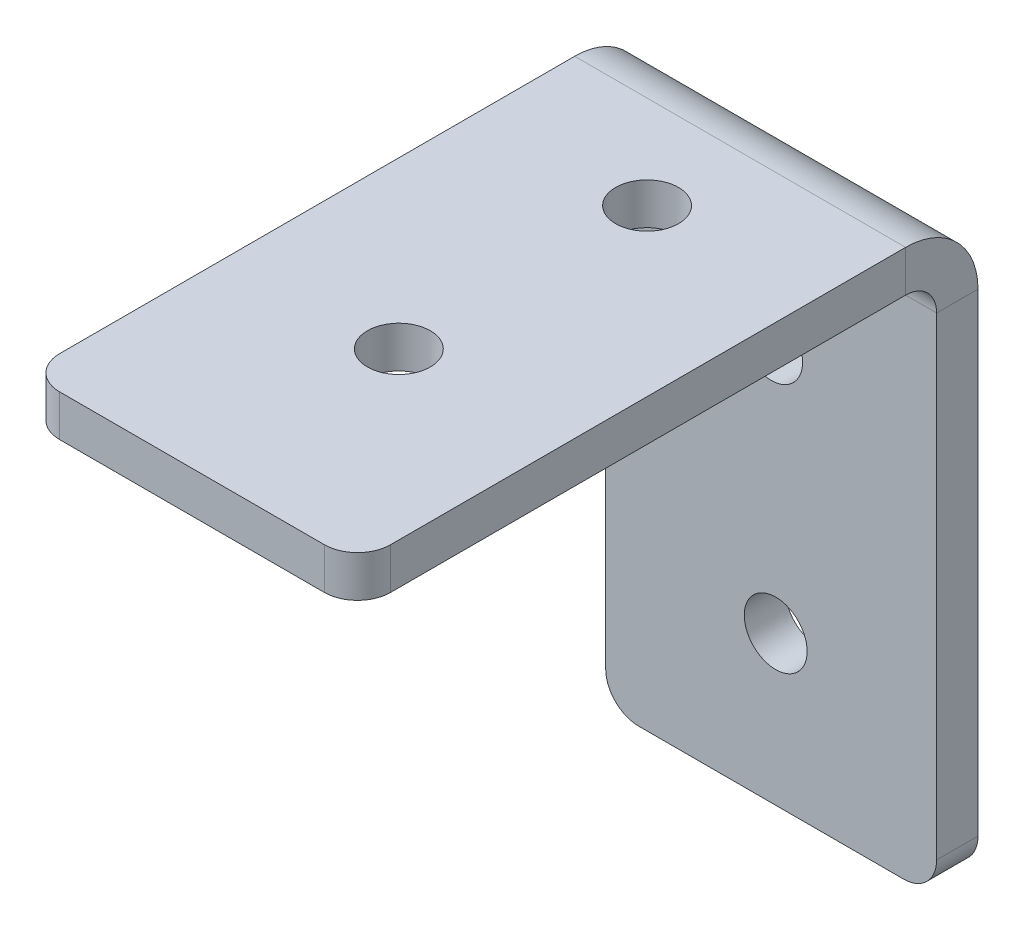
ISO-10303-21;
HEADER;
FILE_DESCRIPTION(('STEP AP214'),'2;1');
FILE_NAME('part.step','',(''),(''),'','','');
FILE_SCHEMA(('AUTOMOTIVE_DESIGN { 1 0 10303 214 1 1 1 1 }'));
ENDSEC;
DATA;
#1=APPLICATION_CONTEXT('core data for automotive mechanical design processes');
#2=APPLICATION_PROTOCOL_DEFINITION('international standard','automotive_design',2000,#1);
#3=PRODUCT_CONTEXT('',#1,'mechanical');
#4=PRODUCT('Part','Part','',(#3));
#5=PRODUCT_RELATED_PRODUCT_CATEGORY('part','',(#4));
#6=PRODUCT_DEFINITION_FORMATION('','',#4);
#7=PRODUCT_DEFINITION_CONTEXT('part definition',#1,'design');
#8=PRODUCT_DEFINITION('design','',#6,#7);
#9=PRODUCT_DEFINITION_SHAPE('','',#8);
#10=(LENGTH_UNIT() NAMED_UNIT(*) SI_UNIT(.MILLI.,.METRE.));
#11=(NAMED_UNIT(*) PLANE_ANGLE_UNIT() SI_UNIT($,.RADIAN.));
#12=(NAMED_UNIT(*) SI_UNIT($,.STERADIAN.) SOLID_ANGLE_UNIT());
#13=UNCERTAINTY_MEASURE_WITH_UNIT(LENGTH_MEASURE(1.E-05),#10,'distance_accuracy_value','');
#14=(GEOMETRIC_REPRESENTATION_CONTEXT(3) GLOBAL_UNCERTAINTY_ASSIGNED_CONTEXT((#13)) GLOBAL_UNIT_ASSIGNED_CONTEXT((#10,
#11,#12)) REPRESENTATION_CONTEXT('',''));
#15=CARTESIAN_POINT('',(0.,0.,0.));
#16=DIRECTION('',(0.,0.,1.));
#17=DIRECTION('',(1.,0.,0.));
#18=AXIS2_PLACEMENT_3D('',#15,#16,#17);
#19=CARTESIAN_POINT('',(12.7,19.05,47.625));
#20=DIRECTION('',(1.,0.,0.));
#21=DIRECTION('',(0.,0.,-1.));
#22=AXIS2_PLACEMENT_3D('',#19,#20,#21);
#23=PLANE('',#22);
#24=DIRECTION('',(0.,-1.,0.));
#25=VECTOR('',#24,1.);
#26=CARTESIAN_POINT('',(12.7,19.05,5.555000066));
#27=LINE('',#26,#25);
#28=CARTESIAN_POINT('',(12.7,22.225,5.555000066));
#29=VERTEX_POINT('',#28);
#30=CARTESIAN_POINT('',(12.7,19.05,5.555000066));
#31=VERTEX_POINT('',#30);
#32=EDGE_CURVE('E11',#29,#31,#27,.T.);
#33=ORIENTED_EDGE('',*,*,#32,.F.);
#34=DIRECTION('',(0.,0.,1.));
#35=VECTOR('',#34,1.);
#36=CARTESIAN_POINT('',(12.7,22.225,47.625));
#37=LINE('',#36,#35);
#38=CARTESIAN_POINT('',(12.7,22.225,45.085));
#39=VERTEX_POINT('',#38);
#40=EDGE_CURVE('E105',#39,#29,#37,.F.);
#41=ORIENTED_EDGE('',*,*,#40,.F.);
#42=DIRECTION('',(0.,-1.,0.));
#43=VECTOR('',#42,1.);
#44=CARTESIAN_POINT('',(12.7,19.05,45.085));
#45=LINE('',#44,#43);
#46=CARTESIAN_POINT('',(12.7,19.05,45.085));
#47=VERTEX_POINT('',#46);
#48=EDGE_CURVE('E53',#39,#47,#45,.T.);
#49=ORIENTED_EDGE('',*,*,#48,.T.);
#50=DIRECTION('',(0.,0.,-1.));
#51=VECTOR('',#50,1.);
#52=CARTESIAN_POINT('',(12.7,19.05,47.625));
#53=LINE('',#52,#51);
#54=EDGE_CURVE('E108',#47,#31,#53,.T.);
#55=ORIENTED_EDGE('',*,*,#54,.T.);
#56=EDGE_LOOP('',(#33,#41,#49,#55));
#57=FACE_BOUND('',#56,.T.);
#58=ADVANCED_FACE('F42',(#57),#23,.T.);
#59=CARTESIAN_POINT('',(10.16,19.05,45.085));
#60=DIRECTION('',(0.,1.,0.));
#61=DIRECTION('',(-1.,0.,0.));
#62=AXIS2_PLACEMENT_3D('',#59,#60,#61);
#63=CYLINDRICAL_SURFACE('',#62,2.54);
#64=ORIENTED_EDGE('',*,*,#48,.F.);
#65=CARTESIAN_POINT('',(10.16,22.225,45.085));
#66=DIRECTION('',(0.,1.,0.));
#67=DIRECTION('',(-1.,0.,0.));
#68=AXIS2_PLACEMENT_3D('',#65,#66,#67);
#69=CIRCLE('',#68,2.54);
#70=CARTESIAN_POINT('',(10.16,22.225,47.625));
#71=VERTEX_POINT('',#70);
#72=EDGE_CURVE('E135',#39,#71,#69,.F.);
#73=ORIENTED_EDGE('',*,*,#72,.T.);
#74=DIRECTION('',(0.,-1.,0.));
#75=VECTOR('',#74,1.);
#76=CARTESIAN_POINT('',(10.16,19.05,47.625));
#77=LINE('',#76,#75);
#78=CARTESIAN_POINT('',(10.16,19.05,47.625));
#79=VERTEX_POINT('',#78);
#80=EDGE_CURVE('E185',#71,#79,#77,.T.);
#81=ORIENTED_EDGE('',*,*,#80,.T.);
#82=CARTESIAN_POINT('',(10.16,19.05,45.085));
#83=DIRECTION('',(0.,1.,0.));
#84=DIRECTION('',(-1.,0.,0.));
#85=AXIS2_PLACEMENT_3D('',#82,#83,#84);
#86=CIRCLE('',#85,2.54);
#87=EDGE_CURVE('E199',#47,#79,#86,.F.);
#88=ORIENTED_EDGE('',*,*,#87,.F.);
#89=EDGE_LOOP('',(#64,#73,#81,#88));
#90=FACE_BOUND('',#89,.T.);
#91=ADVANCED_FACE('F206',(#90),#63,.T.);
#92=CARTESIAN_POINT('',(-12.7,19.05,47.625));
#93=DIRECTION('',(0.,0.,1.));
#94=DIRECTION('',(1.,0.,0.));
#95=AXIS2_PLACEMENT_3D('',#92,#93,#94);
#96=PLANE('',#95);
#97=ORIENTED_EDGE('',*,*,#80,.F.);
#98=DIRECTION('',(-1.,0.,0.));
#99=VECTOR('',#98,1.);
#100=CARTESIAN_POINT('',(-12.7,22.225,47.625));
#101=LINE('',#100,#99);
#102=CARTESIAN_POINT('',(-10.16,22.225,47.625));
#103=VERTEX_POINT('',#102);
#104=EDGE_CURVE('E297',#103,#71,#101,.F.);
#105=ORIENTED_EDGE('',*,*,#104,.F.);
#106=DIRECTION('',(0.,-1.,0.));
#107=VECTOR('',#106,1.);
#108=CARTESIAN_POINT('',(-10.16,19.05,47.625));
#109=LINE('',#108,#107);
#110=CARTESIAN_POINT('',(-10.16,19.05,47.625));
#111=VERTEX_POINT('',#110);
#112=EDGE_CURVE('E181',#103,#111,#109,.T.);
#113=ORIENTED_EDGE('',*,*,#112,.T.);
#114=DIRECTION('',(1.,0.,0.));
#115=VECTOR('',#114,1.);
#116=CARTESIAN_POINT('',(-12.7,19.05,47.625));
#117=LINE('',#116,#115);
#118=EDGE_CURVE('E208',#111,#79,#117,.T.);
#119=ORIENTED_EDGE('',*,*,#118,.T.);
#120=EDGE_LOOP('',(#97,#105,#113,#119));
#121=FACE_BOUND('',#120,.T.);
#122=ADVANCED_FACE('F332',(#121),#96,.T.);
#123=CARTESIAN_POINT('',(-10.16,19.05,45.085));
#124=DIRECTION('',(0.,1.,0.));
#125=DIRECTION('',(-1.,0.,0.));
#126=AXIS2_PLACEMENT_3D('',#123,#124,#125);
#127=CYLINDRICAL_SURFACE('',#126,2.54);
#128=ORIENTED_EDGE('',*,*,#112,.F.);
#129=CARTESIAN_POINT('',(-10.16,22.225,45.085));
#130=DIRECTION('',(0.,1.,0.));
#131=DIRECTION('',(-1.,0.,0.));
#132=AXIS2_PLACEMENT_3D('',#129,#130,#131);
#133=CIRCLE('',#132,2.54);
#134=CARTESIAN_POINT('',(-12.7,22.225,45.085));
#135=VERTEX_POINT('',#134);
#136=EDGE_CURVE('E293',#103,#135,#133,.F.);
#137=ORIENTED_EDGE('',*,*,#136,.T.);
#138=DIRECTION('',(0.,-1.,0.));
#139=VECTOR('',#138,1.);
#140=CARTESIAN_POINT('',(-12.7,19.05,45.085));
#141=LINE('',#140,#139);
#142=CARTESIAN_POINT('',(-12.7,19.05,45.085));
#143=VERTEX_POINT('',#142);
#144=EDGE_CURVE('E177',#135,#143,#141,.T.);
#145=ORIENTED_EDGE('',*,*,#144,.T.);
#146=CARTESIAN_POINT('',(-10.16,19.05,45.085));
#147=DIRECTION('',(0.,1.,0.));
#148=DIRECTION('',(-1.,0.,0.));
#149=AXIS2_PLACEMENT_3D('',#146,#147,#148);
#150=CIRCLE('',#149,2.54);
#151=EDGE_CURVE('E211',#111,#143,#150,.F.);
#152=ORIENTED_EDGE('',*,*,#151,.F.);
#153=EDGE_LOOP('',(#128,#137,#145,#152));
#154=FACE_BOUND('',#153,.T.);
#155=ADVANCED_FACE('F403',(#154),#127,.T.);
#156=CARTESIAN_POINT('',(-12.7,19.05,47.625));
#157=DIRECTION('',(1.,0.,0.));
#158=DIRECTION('',(0.,0.,-1.));
#159=AXIS2_PLACEMENT_3D('',#156,#157,#158);
#160=PLANE('',#159);
#161=ORIENTED_EDGE('',*,*,#144,.F.);
#162=DIRECTION('',(0.,0.,1.));
#163=VECTOR('',#162,1.);
#164=CARTESIAN_POINT('',(-12.7,22.225,47.625));
#165=LINE('',#164,#163);
#166=CARTESIAN_POINT('',(-12.7,22.225,5.555000066));
#167=VERTEX_POINT('',#166);
#168=EDGE_CURVE('E269',#135,#167,#165,.F.);
#169=ORIENTED_EDGE('',*,*,#168,.T.);
#170=DIRECTION('',(0.,-1.,0.));
#171=VECTOR('',#170,1.);
#172=CARTESIAN_POINT('',(-12.7,19.05,5.555000066));
#173=LINE('',#172,#171);
#174=CARTESIAN_POINT('',(-12.7,19.05,5.555000066));
#175=VERTEX_POINT('',#174);
#176=EDGE_CURVE('E173',#167,#175,#173,.T.);
#177=ORIENTED_EDGE('',*,*,#176,.T.);
#178=DIRECTION('',(0.,0.,-1.));
#179=VECTOR('',#178,1.);
#180=CARTESIAN_POINT('',(-12.7,19.05,47.625));
#181=LINE('',#180,#179);
#182=EDGE_CURVE('E218',#143,#175,#181,.T.);
#183=ORIENTED_EDGE('',*,*,#182,.F.);
#184=EDGE_LOOP('',(#161,#169,#177,#183));
#185=FACE_BOUND('',#184,.T.);
#186=ADVANCED_FACE('F398',(#185),#160,.F.);
#187=CARTESIAN_POINT('',(-12.7,16.669999934,5.555000066));
#188=DIRECTION('',(-1.,0.,0.));
#189=DIRECTION('',(0.,0.,1.));
#190=AXIS2_PLACEMENT_3D('',#187,#188,#189);
#191=PLANE('',#190);
#192=ORIENTED_EDGE('',*,*,#176,.F.);
#193=CARTESIAN_POINT('',(-12.7,16.669999934,5.555000066));
#194=DIRECTION('',(-1.,0.,0.));
#195=DIRECTION('',(0.,-1.,0.));
#196=AXIS2_PLACEMENT_3D('',#193,#194,#195);
#197=CIRCLE('',#196,5.555000066);
#198=CARTESIAN_POINT('',(-12.7,16.669999934,0.));
#199=VERTEX_POINT('',#198);
#200=EDGE_CURVE('E123',#167,#199,#197,.T.);
#201=ORIENTED_EDGE('',*,*,#200,.T.);
#202=DIRECTION('',(0.,0.,1.));
#203=VECTOR('',#202,1.);
#204=CARTESIAN_POINT('',(-12.7,16.669999934,3.175));
#205=LINE('',#204,#203);
#206=CARTESIAN_POINT('',(-12.7,16.669999934,3.175));
#207=VERTEX_POINT('',#206);
#208=EDGE_CURVE('E61',#199,#207,#205,.T.);
#209=ORIENTED_EDGE('',*,*,#208,.T.);
#210=CARTESIAN_POINT('',(-12.7,16.669999934,5.555000066));
#211=DIRECTION('',(1.,0.,0.));
#212=DIRECTION('',(0.,0.,-1.));
#213=AXIS2_PLACEMENT_3D('',#210,#211,#212);
#214=CIRCLE('',#213,2.380000066);
#215=EDGE_CURVE('E258',#175,#207,#214,.F.);
#216=ORIENTED_EDGE('',*,*,#215,.F.);
#217=EDGE_LOOP('',(#192,#201,#209,#216));
#218=FACE_BOUND('',#217,.T.);
#219=ADVANCED_FACE('F395',(#218),#191,.T.);
#220=CARTESIAN_POINT('',(-12.7,-22.225,3.175));
#221=DIRECTION('',(1.,0.,0.));
#222=DIRECTION('',(0.,-1.,0.));
#223=AXIS2_PLACEMENT_3D('',#220,#221,#222);
#224=PLANE('',#223);
#225=ORIENTED_EDGE('',*,*,#208,.F.);
#226=DIRECTION('',(0.,1.,0.));
#227=VECTOR('',#226,1.);
#228=CARTESIAN_POINT('',(-12.7,0.,0.));
#229=LINE('',#228,#227);
#230=CARTESIAN_POINT('',(-12.7,-19.685,0.));
#231=VERTEX_POINT('',#230);
#232=EDGE_CURVE('E277',#199,#231,#229,.F.);
#233=ORIENTED_EDGE('',*,*,#232,.T.);
#234=DIRECTION('',(0.,0.,1.));
#235=VECTOR('',#234,1.);
#236=CARTESIAN_POINT('',(-12.7,-19.685,3.175));
#237=LINE('',#236,#235);
#238=CARTESIAN_POINT('',(-12.7,-19.685,3.175));
#239=VERTEX_POINT('',#238);
#240=EDGE_CURVE('E167',#231,#239,#237,.T.);
#241=ORIENTED_EDGE('',*,*,#240,.T.);
#242=DIRECTION('',(0.,-1.,0.));
#243=VECTOR('',#242,1.);
#244=CARTESIAN_POINT('',(-12.7,-22.225,3.175));
#245=LINE('',#244,#243);
#246=EDGE_CURVE('E241',#207,#239,#245,.T.);
#247=ORIENTED_EDGE('',*,*,#246,.F.);
#248=EDGE_LOOP('',(#225,#233,#241,#247));
#249=FACE_BOUND('',#248,.T.);
#250=ADVANCED_FACE('F373',(#249),#224,.F.);
#251=CARTESIAN_POINT('',(-10.16,-19.685,3.175));
#252=DIRECTION('',(0.,0.,-1.));
#253=DIRECTION('',(-1.,0.,0.));
#254=AXIS2_PLACEMENT_3D('',#251,#252,#253);
#255=CYLINDRICAL_SURFACE('',#254,2.54);
#256=ORIENTED_EDGE('',*,*,#240,.F.);
#257=CARTESIAN_POINT('',(-10.16,-19.685,0.));
#258=DIRECTION('',(0.,0.,-1.));
#259=DIRECTION('',(-1.,0.,0.));
#260=AXIS2_PLACEMENT_3D('',#257,#258,#259);
#261=CIRCLE('',#260,2.54);
#262=CARTESIAN_POINT('',(-10.16,-22.225,0.));
#263=VERTEX_POINT('',#262);
#264=EDGE_CURVE('E129',#231,#263,#261,.F.);
#265=ORIENTED_EDGE('',*,*,#264,.T.);
#266=DIRECTION('',(0.,0.,1.));
#267=VECTOR('',#266,1.);
#268=CARTESIAN_POINT('',(-10.16,-22.225,3.175));
#269=LINE('',#268,#267);
#270=CARTESIAN_POINT('',(-10.16,-22.225,3.175));
#271=VERTEX_POINT('',#270);
#272=EDGE_CURVE('E163',#263,#271,#269,.T.);
#273=ORIENTED_EDGE('',*,*,#272,.T.);
#274=CARTESIAN_POINT('',(-10.16,-19.685,3.175));
#275=DIRECTION('',(0.,0.,-1.));
#276=DIRECTION('',(-1.,0.,0.));
#277=AXIS2_PLACEMENT_3D('',#274,#275,#276);
#278=CIRCLE('',#277,2.54);
#279=EDGE_CURVE('E245',#239,#271,#278,.F.);
#280=ORIENTED_EDGE('',*,*,#279,.F.);
#281=EDGE_LOOP('',(#256,#265,#273,#280));
#282=FACE_BOUND('',#281,.T.);
#283=ADVANCED_FACE('F379',(#282),#255,.T.);
#284=CARTESIAN_POINT('',(-12.7,-22.225,3.175));
#285=DIRECTION('',(0.,1.,0.));
#286=DIRECTION('',(1.,0.,0.));
#287=AXIS2_PLACEMENT_3D('',#284,#285,#286);
#288=PLANE('',#287);
#289=ORIENTED_EDGE('',*,*,#272,.F.);
#290=DIRECTION('',(-1.,0.,0.));
#291=VECTOR('',#290,1.);
#292=CARTESIAN_POINT('',(0.,-22.225,0.));
#293=LINE('',#292,#291);
#294=CARTESIAN_POINT('',(10.16,-22.225,0.));
#295=VERTEX_POINT('',#294);
#296=EDGE_CURVE('E273',#263,#295,#293,.F.);
#297=ORIENTED_EDGE('',*,*,#296,.T.);
#298=DIRECTION('',(0.,0.,1.));
#299=VECTOR('',#298,1.);
#300=CARTESIAN_POINT('',(10.16,-22.225,3.175));
#301=LINE('',#300,#299);
#302=CARTESIAN_POINT('',(10.16,-22.225,3.175));
#303=VERTEX_POINT('',#302);
#304=EDGE_CURVE('E159',#295,#303,#301,.T.);
#305=ORIENTED_EDGE('',*,*,#304,.T.);
#306=DIRECTION('',(1.,0.,0.));
#307=VECTOR('',#306,1.);
#308=CARTESIAN_POINT('',(-12.7,-22.225,3.175));
#309=LINE('',#308,#307);
#310=EDGE_CURVE('E229',#271,#303,#309,.T.);
#311=ORIENTED_EDGE('',*,*,#310,.F.);
#312=EDGE_LOOP('',(#289,#297,#305,#311));
#313=FACE_BOUND('',#312,.T.);
#314=ADVANCED_FACE('F385',(#313),#288,.F.);
#315=CARTESIAN_POINT('',(10.16,-19.685,3.175));
#316=DIRECTION('',(0.,0.,-1.));
#317=DIRECTION('',(-1.,0.,0.));
#318=AXIS2_PLACEMENT_3D('',#315,#316,#317);
#319=CYLINDRICAL_SURFACE('',#318,2.54);
#320=ORIENTED_EDGE('',*,*,#304,.F.);
#321=CARTESIAN_POINT('',(10.16,-19.685,0.));
#322=DIRECTION('',(0.,0.,-1.));
#323=DIRECTION('',(-1.,0.,0.));
#324=AXIS2_PLACEMENT_3D('',#321,#322,#323);
#325=CIRCLE('',#324,2.54);
#326=CARTESIAN_POINT('',(12.7,-19.685,0.));
#327=VERTEX_POINT('',#326);
#328=EDGE_CURVE('E278',#295,#327,#325,.F.);
#329=ORIENTED_EDGE('',*,*,#328,.T.);
#330=DIRECTION('',(0.,0.,1.));
#331=VECTOR('',#330,1.);
#332=CARTESIAN_POINT('',(12.7,-19.685,3.175));
#333=LINE('',#332,#331);
#334=CARTESIAN_POINT('',(12.7,-19.685,3.175));
#335=VERTEX_POINT('',#334);
#336=EDGE_CURVE('E155',#327,#335,#333,.T.);
#337=ORIENTED_EDGE('',*,*,#336,.T.);
#338=CARTESIAN_POINT('',(10.16,-19.685,3.175));
#339=DIRECTION('',(0.,0.,-1.));
#340=DIRECTION('',(-1.,0.,0.));
#341=AXIS2_PLACEMENT_3D('',#338,#339,#340);
#342=CIRCLE('',#341,2.54);
#343=EDGE_CURVE('E233',#303,#335,#342,.F.);
#344=ORIENTED_EDGE('',*,*,#343,.F.);
#345=EDGE_LOOP('',(#320,#329,#337,#344));
#346=FACE_BOUND('',#345,.T.);
#347=ADVANCED_FACE('F345',(#346),#319,.T.);
#348=CARTESIAN_POINT('',(12.7,-22.225,3.175));
#349=DIRECTION('',(-1.,0.,0.));
#350=DIRECTION('',(0.,1.,0.));
#351=AXIS2_PLACEMENT_3D('',#348,#349,#350);
#352=PLANE('',#351);
#353=ORIENTED_EDGE('',*,*,#336,.F.);
#354=DIRECTION('',(0.,1.,0.));
#355=VECTOR('',#354,1.);
#356=CARTESIAN_POINT('',(12.7,0.,0.));
#357=LINE('',#356,#355);
#358=CARTESIAN_POINT('',(12.7,16.669999934,0.));
#359=VERTEX_POINT('',#358);
#360=EDGE_CURVE('E274',#327,#359,#357,.T.);
#361=ORIENTED_EDGE('',*,*,#360,.T.);
#362=DIRECTION('',(0.,0.,1.));
#363=VECTOR('',#362,1.);
#364=CARTESIAN_POINT('',(12.7,16.669999934,3.175));
#365=LINE('',#364,#363);
#366=CARTESIAN_POINT('',(12.7,16.669999934,3.175));
#367=VERTEX_POINT('',#366);
#368=EDGE_CURVE('E46',#359,#367,#365,.T.);
#369=ORIENTED_EDGE('',*,*,#368,.T.);
#370=DIRECTION('',(0.,1.,0.));
#371=VECTOR('',#370,1.);
#372=CARTESIAN_POINT('',(12.7,-22.225,3.175));
#373=LINE('',#372,#371);
#374=EDGE_CURVE('E237',#335,#367,#373,.T.);
#375=ORIENTED_EDGE('',*,*,#374,.F.);
#376=EDGE_LOOP('',(#353,#361,#369,#375));
#377=FACE_BOUND('',#376,.T.);
#378=ADVANCED_FACE('F340',(#377),#352,.F.);
#379=CARTESIAN_POINT('',(0.,19.05,12.7));
#380=DIRECTION('',(0.,1.,0.));
#381=DIRECTION('',(-1.,0.,0.));
#382=AXIS2_PLACEMENT_3D('',#379,#380,#381);
#383=CYLINDRICAL_SURFACE('',#382,2.413);
#384=CARTESIAN_POINT('',(0.,19.05,12.7));
#385=DIRECTION('',(0.,1.,0.));
#386=DIRECTION('',(-1.,0.,0.));
#387=AXIS2_PLACEMENT_3D('',#384,#385,#386);
#388=CIRCLE('',#387,2.413);
#389=CARTESIAN_POINT('',(-2.413,19.05,12.7));
#390=VERTEX_POINT('',#389);
#391=EDGE_CURVE('E261',#390,#390,#388,.T.);
#392=ORIENTED_EDGE('',*,*,#391,.F.);
#393=EDGE_LOOP('',(#392));
#394=FACE_BOUND('',#393,.T.);
#395=CARTESIAN_POINT('',(0.,22.225,12.7));
#396=DIRECTION('',(0.,1.,0.));
#397=DIRECTION('',(-1.,0.,0.));
#398=AXIS2_PLACEMENT_3D('',#395,#396,#397);
#399=CIRCLE('',#398,2.413);
#400=CARTESIAN_POINT('',(-2.413,22.225,12.7));
#401=VERTEX_POINT('',#400);
#402=EDGE_CURVE('E145',#401,#401,#399,.T.);
#403=ORIENTED_EDGE('',*,*,#402,.T.);
#404=EDGE_LOOP('',(#403));
#405=FACE_BOUND('',#404,.T.);
#406=ADVANCED_FACE('F311',(#394,#405),#383,.F.);
#407=CARTESIAN_POINT('',(0.,19.05,31.75));
#408=DIRECTION('',(0.,1.,0.));
#409=DIRECTION('',(-1.,0.,0.));
#410=AXIS2_PLACEMENT_3D('',#407,#408,#409);
#411=CYLINDRICAL_SURFACE('',#410,2.413);
#412=CARTESIAN_POINT('',(0.,19.05,31.75));
#413=DIRECTION('',(0.,1.,0.));
#414=DIRECTION('',(-1.,0.,0.));
#415=AXIS2_PLACEMENT_3D('',#412,#413,#414);
#416=CIRCLE('',#415,2.413);
#417=CARTESIAN_POINT('',(-2.413,19.05,31.75));
#418=VERTEX_POINT('',#417);
#419=EDGE_CURVE('E204',#418,#418,#416,.T.);
#420=ORIENTED_EDGE('',*,*,#419,.F.);
#421=EDGE_LOOP('',(#420));
#422=FACE_BOUND('',#421,.T.);
#423=CARTESIAN_POINT('',(0.,22.225,31.75));
#424=DIRECTION('',(0.,1.,0.));
#425=DIRECTION('',(-1.,0.,0.));
#426=AXIS2_PLACEMENT_3D('',#423,#424,#425);
#427=CIRCLE('',#426,2.413);
#428=CARTESIAN_POINT('',(-2.413,22.225,31.75));
#429=VERTEX_POINT('',#428);
#430=EDGE_CURVE('E137',#429,#429,#427,.T.);
#431=ORIENTED_EDGE('',*,*,#430,.T.);
#432=EDGE_LOOP('',(#431));
#433=FACE_BOUND('',#432,.T.);
#434=ADVANCED_FACE('F44',(#422,#433),#411,.F.);
#435=CARTESIAN_POINT('',(0.348627450980393,-10.795,3.175));
#436=DIRECTION('',(0.,0.,-1.));
#437=DIRECTION('',(-1.,0.,0.));
#438=AXIS2_PLACEMENT_3D('',#435,#436,#437);
#439=CYLINDRICAL_SURFACE('',#438,2.413);
#440=CARTESIAN_POINT('',(0.348627450980393,-10.795,3.175));
#441=DIRECTION('',(0.,0.,1.));
#442=DIRECTION('',(1.,0.,0.));
#443=AXIS2_PLACEMENT_3D('',#440,#441,#442);
#444=CIRCLE('',#443,2.413);
#445=CARTESIAN_POINT('',(2.76162745098039,-10.795,3.175));
#446=VERTEX_POINT('',#445);
#447=EDGE_CURVE('E221',#446,#446,#444,.T.);
#448=ORIENTED_EDGE('',*,*,#447,.T.);
#449=EDGE_LOOP('',(#448));
#450=FACE_BOUND('',#449,.T.);
#451=CARTESIAN_POINT('',(0.348627450980393,-10.795,0.));
#452=DIRECTION('',(0.,0.,1.));
#453=DIRECTION('',(1.,0.,0.));
#454=AXIS2_PLACEMENT_3D('',#451,#452,#453);
#455=CIRCLE('',#454,2.413);
#456=CARTESIAN_POINT('',(2.76162745098039,-10.795,0.));
#457=VERTEX_POINT('',#456);
#458=EDGE_CURVE('E264',#457,#457,#455,.T.);
#459=ORIENTED_EDGE('',*,*,#458,.F.);
#460=EDGE_LOOP('',(#459));
#461=FACE_BOUND('',#460,.T.);
#462=ADVANCED_FACE('F310',(#450,#461),#439,.F.);
#463=CARTESIAN_POINT('',(0.,8.25499999999999,3.175));
#464=DIRECTION('',(0.,0.,-1.));
#465=DIRECTION('',(-1.,0.,0.));
#466=AXIS2_PLACEMENT_3D('',#463,#464,#465);
#467=CYLINDRICAL_SURFACE('',#466,2.413);
#468=CARTESIAN_POINT('',(0.,8.25499999999999,3.175));
#469=DIRECTION('',(0.,0.,1.));
#470=DIRECTION('',(1.,0.,0.));
#471=AXIS2_PLACEMENT_3D('',#468,#469,#470);
#472=CIRCLE('',#471,2.413);
#473=CARTESIAN_POINT('',(2.413,8.25499999999999,3.175));
#474=VERTEX_POINT('',#473);
#475=EDGE_CURVE('E225',#474,#474,#472,.T.);
#476=ORIENTED_EDGE('',*,*,#475,.T.);
#477=EDGE_LOOP('',(#476));
#478=FACE_BOUND('',#477,.T.);
#479=CARTESIAN_POINT('',(0.,8.25499999999999,0.));
#480=DIRECTION('',(0.,0.,1.));
#481=DIRECTION('',(1.,0.,0.));
#482=AXIS2_PLACEMENT_3D('',#479,#480,#481);
#483=CIRCLE('',#482,2.413);
#484=CARTESIAN_POINT('',(2.413,8.25499999999999,0.));
#485=VERTEX_POINT('',#484);
#486=EDGE_CURVE('E268',#485,#485,#483,.T.);
#487=ORIENTED_EDGE('',*,*,#486,.F.);
#488=EDGE_LOOP('',(#487));
#489=FACE_BOUND('',#488,.T.);
#490=ADVANCED_FACE('F338',(#478,#489),#467,.F.);
#491=CARTESIAN_POINT('',(12.7,16.669999934,5.555000066));
#492=DIRECTION('',(-1.,0.,0.));
#493=DIRECTION('',(0.,0.,1.));
#494=AXIS2_PLACEMENT_3D('',#491,#492,#493);
#495=PLANE('',#494);
#496=CARTESIAN_POINT('',(12.7,16.669999934,5.555000066));
#497=DIRECTION('',(-1.,0.,0.));
#498=DIRECTION('',(0.,-1.,0.));
#499=AXIS2_PLACEMENT_3D('',#496,#497,#498);
#500=CIRCLE('',#499,5.555000066);
#501=EDGE_CURVE('E121',#359,#29,#500,.F.);
#502=ORIENTED_EDGE('',*,*,#501,.T.);
#503=ORIENTED_EDGE('',*,*,#32,.T.);
#504=CARTESIAN_POINT('',(12.7,16.669999934,5.555000066));
#505=DIRECTION('',(1.,0.,0.));
#506=DIRECTION('',(0.,0.,-1.));
#507=AXIS2_PLACEMENT_3D('',#504,#505,#506);
#508=CIRCLE('',#507,2.380000066);
#509=EDGE_CURVE('E255',#367,#31,#508,.T.);
#510=ORIENTED_EDGE('',*,*,#509,.F.);
#511=ORIENTED_EDGE('',*,*,#368,.F.);
#512=EDGE_LOOP('',(#502,#503,#510,#511));
#513=FACE_BOUND('',#512,.T.);
#514=ADVANCED_FACE('F140',(#513),#495,.F.);
#515=CARTESIAN_POINT('',(0.,0.,3.175));
#516=DIRECTION('',(0.,0.,-1.));
#517=DIRECTION('',(-1.,0.,0.));
#518=AXIS2_PLACEMENT_3D('',#515,#516,#517);
#519=PLANE('',#518);
#520=ORIENTED_EDGE('',*,*,#447,.F.);
#521=EDGE_LOOP('',(#520));
#522=FACE_BOUND('',#521,.T.);
#523=ORIENTED_EDGE('',*,*,#475,.F.);
#524=EDGE_LOOP('',(#523));
#525=FACE_BOUND('',#524,.T.);
#526=ORIENTED_EDGE('',*,*,#374,.T.);
#527=DIRECTION('',(1.,0.,0.));
#528=VECTOR('',#527,1.);
#529=CARTESIAN_POINT('',(-12.7,16.669999934,3.175));
#530=LINE('',#529,#528);
#531=EDGE_CURVE('E251',#367,#207,#530,.F.);
#532=ORIENTED_EDGE('',*,*,#531,.T.);
#533=ORIENTED_EDGE('',*,*,#246,.T.);
#534=ORIENTED_EDGE('',*,*,#279,.T.);
#535=ORIENTED_EDGE('',*,*,#310,.T.);
#536=ORIENTED_EDGE('',*,*,#343,.T.);
#537=EDGE_LOOP('',(#526,#532,#533,#534,#535,#536));
#538=FACE_BOUND('',#537,.T.);
#539=ADVANCED_FACE('F337',(#522,#525,#538),#519,.F.);
#540=CARTESIAN_POINT('',(-12.7,19.05,47.625));
#541=DIRECTION('',(0.,1.,0.));
#542=DIRECTION('',(-1.,0.,0.));
#543=AXIS2_PLACEMENT_3D('',#540,#541,#542);
#544=PLANE('',#543);
#545=ORIENTED_EDGE('',*,*,#391,.T.);
#546=EDGE_LOOP('',(#545));
#547=FACE_BOUND('',#546,.T.);
#548=ORIENTED_EDGE('',*,*,#419,.T.);
#549=EDGE_LOOP('',(#548));
#550=FACE_BOUND('',#549,.T.);
#551=ORIENTED_EDGE('',*,*,#182,.T.);
#552=DIRECTION('',(1.,0.,0.));
#553=VECTOR('',#552,1.);
#554=CARTESIAN_POINT('',(12.7,19.05,5.555000066));
#555=LINE('',#554,#553);
#556=EDGE_CURVE('E202',#175,#31,#555,.T.);
#557=ORIENTED_EDGE('',*,*,#556,.T.);
#558=ORIENTED_EDGE('',*,*,#54,.F.);
#559=ORIENTED_EDGE('',*,*,#87,.T.);
#560=ORIENTED_EDGE('',*,*,#118,.F.);
#561=ORIENTED_EDGE('',*,*,#151,.T.);
#562=EDGE_LOOP('',(#551,#557,#558,#559,#560,#561));
#563=FACE_BOUND('',#562,.T.);
#564=ADVANCED_FACE('F197',(#547,#550,#563),#544,.F.);
#565=CARTESIAN_POINT('',(-12.7,16.669999934,5.555000066));
#566=DIRECTION('',(-1.,0.,0.));
#567=DIRECTION('',(0.,-1.,0.));
#568=AXIS2_PLACEMENT_3D('',#565,#566,#567);
#569=CYLINDRICAL_SURFACE('',#568,2.380000066);
#570=ORIENTED_EDGE('',*,*,#215,.T.);
#571=ORIENTED_EDGE('',*,*,#531,.F.);
#572=ORIENTED_EDGE('',*,*,#509,.T.);
#573=ORIENTED_EDGE('',*,*,#556,.F.);
#574=EDGE_LOOP('',(#570,#571,#572,#573));
#575=FACE_BOUND('',#574,.T.);
#576=ADVANCED_FACE('F323',(#575),#569,.F.);
#577=CARTESIAN_POINT('',(0.,0.,0.));
#578=DIRECTION('',(0.,0.,-1.));
#579=DIRECTION('',(-1.,0.,0.));
#580=AXIS2_PLACEMENT_3D('',#577,#578,#579);
#581=PLANE('',#580);
#582=ORIENTED_EDGE('',*,*,#458,.T.);
#583=EDGE_LOOP('',(#582));
#584=FACE_BOUND('',#583,.T.);
#585=ORIENTED_EDGE('',*,*,#486,.T.);
#586=EDGE_LOOP('',(#585));
#587=FACE_BOUND('',#586,.T.);
#588=ORIENTED_EDGE('',*,*,#360,.F.);
#589=ORIENTED_EDGE('',*,*,#328,.F.);
#590=ORIENTED_EDGE('',*,*,#296,.F.);
#591=ORIENTED_EDGE('',*,*,#264,.F.);
#592=ORIENTED_EDGE('',*,*,#232,.F.);
#593=DIRECTION('',(-1.,0.,0.));
#594=VECTOR('',#593,1.);
#595=CARTESIAN_POINT('',(0.,16.669999934,0.));
#596=LINE('',#595,#594);
#597=EDGE_CURVE('E128',#359,#199,#596,.T.);
#598=ORIENTED_EDGE('',*,*,#597,.F.);
#599=EDGE_LOOP('',(#588,#589,#590,#591,#592,#598));
#600=FACE_BOUND('',#599,.T.);
#601=ADVANCED_FACE('F315',(#584,#587,#600),#581,.T.);
#602=CARTESIAN_POINT('',(-12.7,22.225,47.625));
#603=DIRECTION('',(0.,1.,0.));
#604=DIRECTION('',(-1.,0.,0.));
#605=AXIS2_PLACEMENT_3D('',#602,#603,#604);
#606=PLANE('',#605);
#607=ORIENTED_EDGE('',*,*,#402,.F.);
#608=EDGE_LOOP('',(#607));
#609=FACE_BOUND('',#608,.T.);
#610=ORIENTED_EDGE('',*,*,#430,.F.);
#611=EDGE_LOOP('',(#610));
#612=FACE_BOUND('',#611,.T.);
#613=ORIENTED_EDGE('',*,*,#168,.F.);
#614=ORIENTED_EDGE('',*,*,#136,.F.);
#615=ORIENTED_EDGE('',*,*,#104,.T.);
#616=ORIENTED_EDGE('',*,*,#72,.F.);
#617=ORIENTED_EDGE('',*,*,#40,.T.);
#618=DIRECTION('',(-1.,0.,0.));
#619=VECTOR('',#618,1.);
#620=CARTESIAN_POINT('',(-12.7,22.225,5.555000066));
#621=LINE('',#620,#619);
#622=EDGE_CURVE('E118',#167,#29,#621,.F.);
#623=ORIENTED_EDGE('',*,*,#622,.F.);
#624=EDGE_LOOP('',(#613,#614,#615,#616,#617,#623));
#625=FACE_BOUND('',#624,.T.);
#626=ADVANCED_FACE('F132',(#609,#612,#625),#606,.T.);
#627=CARTESIAN_POINT('',(-12.7,16.669999934,5.555000066));
#628=DIRECTION('',(-1.,0.,0.));
#629=DIRECTION('',(0.,-1.,0.));
#630=AXIS2_PLACEMENT_3D('',#627,#628,#629);
#631=CYLINDRICAL_SURFACE('',#630,5.555000066);
#632=ORIENTED_EDGE('',*,*,#200,.F.);
#633=ORIENTED_EDGE('',*,*,#622,.T.);
#634=ORIENTED_EDGE('',*,*,#501,.F.);
#635=ORIENTED_EDGE('',*,*,#597,.T.);
#636=EDGE_LOOP('',(#632,#633,#634,#635));
#637=FACE_BOUND('',#636,.T.);
#638=ADVANCED_FACE('F119',(#637),#631,.T.);
#639=CLOSED_SHELL('',(#58,#91,#122,#155,#186,#219,#250,#283,#314,#347,#378,#406,#434,#462,#490,
#514,#539,#564,#576,#601,#626,#638));
#640=MANIFOLD_SOLID_BREP('B2',#639);
#641=ADVANCED_BREP_SHAPE_REPRESENTATION('',(#18,#640),#14);
#642=SHAPE_DEFINITION_REPRESENTATION(#9,#641);
ENDSEC;
END-ISO-10303-21;
